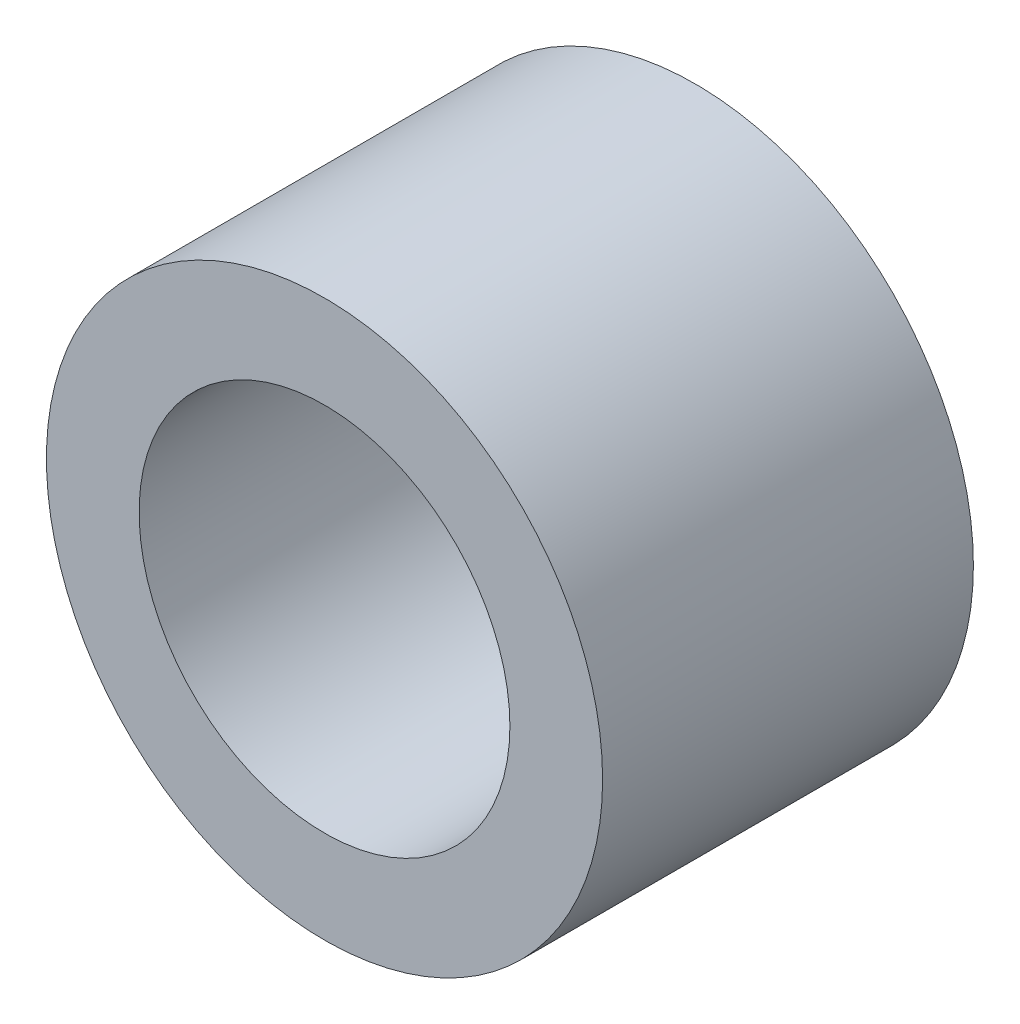
ISO-10303-21;
HEADER;
FILE_DESCRIPTION(('STEP AP214'),'2;1');
FILE_NAME('part.step','',(''),(''),'','','');
FILE_SCHEMA(('AUTOMOTIVE_DESIGN { 1 0 10303 214 1 1 1 1 }'));
ENDSEC;
DATA;
#1=APPLICATION_CONTEXT('core data for automotive mechanical design processes');
#2=APPLICATION_PROTOCOL_DEFINITION('international standard','automotive_design',2000,#1);
#3=PRODUCT_CONTEXT('',#1,'mechanical');
#4=PRODUCT('Part','Part','',(#3));
#5=PRODUCT_RELATED_PRODUCT_CATEGORY('part','',(#4));
#6=PRODUCT_DEFINITION_FORMATION('','',#4);
#7=PRODUCT_DEFINITION_CONTEXT('part definition',#1,'design');
#8=PRODUCT_DEFINITION('design','',#6,#7);
#9=PRODUCT_DEFINITION_SHAPE('','',#8);
#10=(LENGTH_UNIT() NAMED_UNIT(*) SI_UNIT(.MILLI.,.METRE.));
#11=(NAMED_UNIT(*) PLANE_ANGLE_UNIT() SI_UNIT($,.RADIAN.));
#12=(NAMED_UNIT(*) SI_UNIT($,.STERADIAN.) SOLID_ANGLE_UNIT());
#13=UNCERTAINTY_MEASURE_WITH_UNIT(LENGTH_MEASURE(1.E-05),#10,'distance_accuracy_value','');
#14=(GEOMETRIC_REPRESENTATION_CONTEXT(3) GLOBAL_UNCERTAINTY_ASSIGNED_CONTEXT((#13)) GLOBAL_UNIT_ASSIGNED_CONTEXT((#10,
#11,#12)) REPRESENTATION_CONTEXT('',''));
#15=CARTESIAN_POINT('',(0.,0.,0.));
#16=DIRECTION('',(0.,0.,1.));
#17=DIRECTION('',(1.,0.,0.));
#18=AXIS2_PLACEMENT_3D('',#15,#16,#17);
#19=CARTESIAN_POINT('',(0.,0.,10.));
#20=DIRECTION('',(0.,0.,1.));
#21=DIRECTION('',(1.,0.,0.));
#22=AXIS2_PLACEMENT_3D('',#19,#20,#21);
#23=PLANE('',#22);
#24=CARTESIAN_POINT('',(0.,0.,10.));
#25=DIRECTION('',(0.,0.,1.));
#26=DIRECTION('',(1.,0.,0.));
#27=AXIS2_PLACEMENT_3D('',#24,#25,#26);
#28=CIRCLE('',#27,7.5);
#29=CARTESIAN_POINT('',(7.5,0.,10.));
#30=VERTEX_POINT('',#29);
#31=EDGE_CURVE('E10',#30,#30,#28,.T.);
#32=ORIENTED_EDGE('',*,*,#31,.T.);
#33=EDGE_LOOP('',(#32));
#34=FACE_BOUND('',#33,.T.);
#35=CARTESIAN_POINT('',(0.,0.,10.));
#36=DIRECTION('',(0.,0.,1.));
#37=DIRECTION('',(1.,0.,0.));
#38=AXIS2_PLACEMENT_3D('',#35,#36,#37);
#39=CIRCLE('',#38,5.);
#40=CARTESIAN_POINT('',(5.,0.,10.));
#41=VERTEX_POINT('',#40);
#42=EDGE_CURVE('E46',#41,#41,#39,.T.);
#43=ORIENTED_EDGE('',*,*,#42,.F.);
#44=EDGE_LOOP('',(#43));
#45=FACE_BOUND('',#44,.T.);
#46=ADVANCED_FACE('F35',(#34,#45),#23,.T.);
#47=CARTESIAN_POINT('',(0.,0.,0.));
#48=DIRECTION('',(0.,0.,1.));
#49=DIRECTION('',(1.,0.,0.));
#50=AXIS2_PLACEMENT_3D('',#47,#48,#49);
#51=PLANE('',#50);
#52=CARTESIAN_POINT('',(0.,0.,0.));
#53=DIRECTION('',(0.,0.,1.));
#54=DIRECTION('',(1.,0.,0.));
#55=AXIS2_PLACEMENT_3D('',#52,#53,#54);
#56=CIRCLE('',#55,7.5);
#57=CARTESIAN_POINT('',(7.5,0.,0.));
#58=VERTEX_POINT('',#57);
#59=EDGE_CURVE('E39',#58,#58,#56,.T.);
#60=ORIENTED_EDGE('',*,*,#59,.F.);
#61=EDGE_LOOP('',(#60));
#62=FACE_BOUND('',#61,.T.);
#63=CARTESIAN_POINT('',(0.,0.,0.));
#64=DIRECTION('',(0.,0.,1.));
#65=DIRECTION('',(1.,0.,0.));
#66=AXIS2_PLACEMENT_3D('',#63,#64,#65);
#67=CIRCLE('',#66,5.);
#68=CARTESIAN_POINT('',(5.,0.,0.));
#69=VERTEX_POINT('',#68);
#70=EDGE_CURVE('E48',#69,#69,#67,.T.);
#71=ORIENTED_EDGE('',*,*,#70,.T.);
#72=EDGE_LOOP('',(#71));
#73=FACE_BOUND('',#72,.T.);
#74=ADVANCED_FACE('F58',(#62,#73),#51,.F.);
#75=CARTESIAN_POINT('',(0.,0.,10.));
#76=DIRECTION('',(0.,0.,-1.));
#77=DIRECTION('',(-1.,0.,0.));
#78=AXIS2_PLACEMENT_3D('',#75,#76,#77);
#79=CYLINDRICAL_SURFACE('',#78,7.5);
#80=ORIENTED_EDGE('',*,*,#31,.F.);
#81=EDGE_LOOP('',(#80));
#82=FACE_BOUND('',#81,.T.);
#83=ORIENTED_EDGE('',*,*,#59,.T.);
#84=EDGE_LOOP('',(#83));
#85=FACE_BOUND('',#84,.T.);
#86=ADVANCED_FACE('F37',(#82,#85),#79,.T.);
#87=CARTESIAN_POINT('',(0.,0.,10.));
#88=DIRECTION('',(0.,0.,-1.));
#89=DIRECTION('',(-1.,0.,0.));
#90=AXIS2_PLACEMENT_3D('',#87,#88,#89);
#91=CYLINDRICAL_SURFACE('',#90,5.);
#92=ORIENTED_EDGE('',*,*,#42,.T.);
#93=EDGE_LOOP('',(#92));
#94=FACE_BOUND('',#93,.T.);
#95=ORIENTED_EDGE('',*,*,#70,.F.);
#96=EDGE_LOOP('',(#95));
#97=FACE_BOUND('',#96,.T.);
#98=ADVANCED_FACE('F54',(#94,#97),#91,.F.);
#99=CLOSED_SHELL('',(#46,#74,#86,#98));
#100=MANIFOLD_SOLID_BREP('B2',#99);
#101=ADVANCED_BREP_SHAPE_REPRESENTATION('',(#18,#100),#14);
#102=SHAPE_DEFINITION_REPRESENTATION(#9,#101);
ENDSEC;
END-ISO-10303-21;
